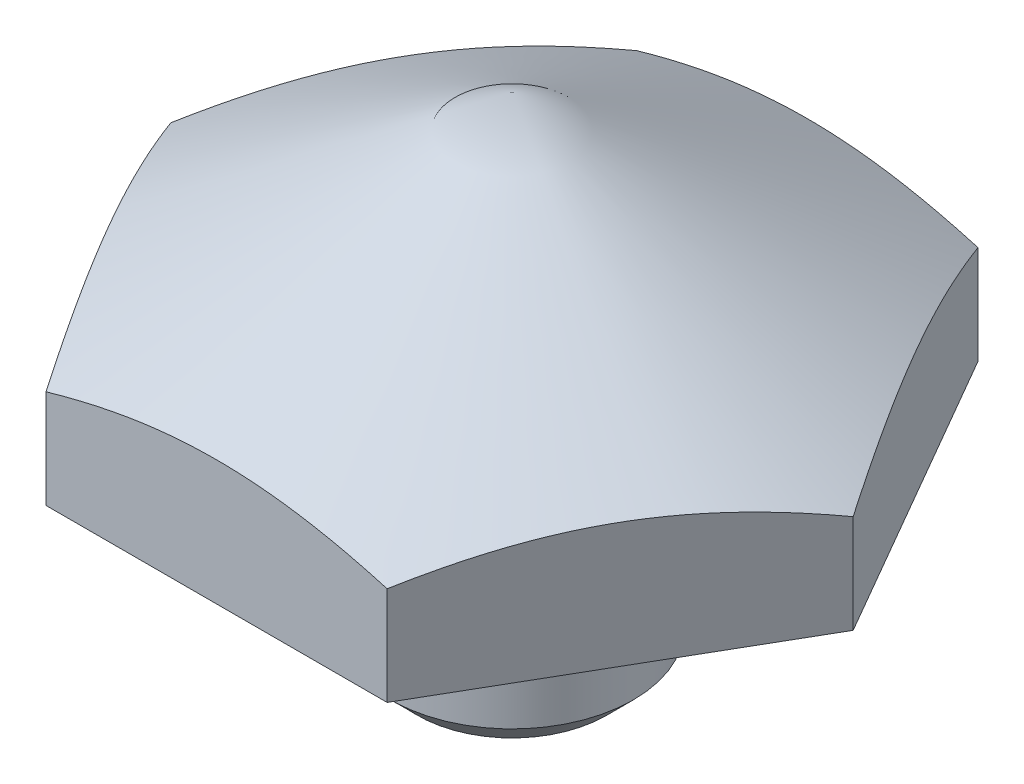
ISO-10303-21;
HEADER;
FILE_DESCRIPTION(('STEP AP214'),'2;1');
FILE_NAME('part.step','',(''),(''),'','','');
FILE_SCHEMA(('AUTOMOTIVE_DESIGN { 1 0 10303 214 1 1 1 1 }'));
ENDSEC;
DATA;
#1=APPLICATION_CONTEXT('core data for automotive mechanical design processes');
#2=APPLICATION_PROTOCOL_DEFINITION('international standard','automotive_design',2000,#1);
#3=PRODUCT_CONTEXT('',#1,'mechanical');
#4=PRODUCT('Part','Part','',(#3));
#5=PRODUCT_RELATED_PRODUCT_CATEGORY('part','',(#4));
#6=PRODUCT_DEFINITION_FORMATION('','',#4);
#7=PRODUCT_DEFINITION_CONTEXT('part definition',#1,'design');
#8=PRODUCT_DEFINITION('design','',#6,#7);
#9=PRODUCT_DEFINITION_SHAPE('','',#8);
#10=(LENGTH_UNIT() NAMED_UNIT(*) SI_UNIT(.MILLI.,.METRE.));
#11=(NAMED_UNIT(*) PLANE_ANGLE_UNIT() SI_UNIT($,.RADIAN.));
#12=(NAMED_UNIT(*) SI_UNIT($,.STERADIAN.) SOLID_ANGLE_UNIT());
#13=UNCERTAINTY_MEASURE_WITH_UNIT(LENGTH_MEASURE(1.E-05),#10,'distance_accuracy_value','');
#14=(GEOMETRIC_REPRESENTATION_CONTEXT(3) GLOBAL_UNCERTAINTY_ASSIGNED_CONTEXT((#13)) GLOBAL_UNIT_ASSIGNED_CONTEXT((#10,
#11,#12)) REPRESENTATION_CONTEXT('',''));
#15=CARTESIAN_POINT('',(0.,0.,0.));
#16=DIRECTION('',(0.,0.,1.));
#17=DIRECTION('',(1.,0.,0.));
#18=AXIS2_PLACEMENT_3D('',#15,#16,#17);
#19=CARTESIAN_POINT('',(0.,0.,0.));
#20=DIRECTION('',(0.,-1.,0.));
#21=DIRECTION('',(1.,0.,0.));
#22=AXIS2_PLACEMENT_3D('',#19,#20,#21);
#23=PLANE('',#22);
#24=CARTESIAN_POINT('',(0.,0.,0.));
#25=DIRECTION('',(0.,-1.,0.));
#26=DIRECTION('',(1.,0.,0.));
#27=AXIS2_PLACEMENT_3D('',#24,#25,#26);
#28=CIRCLE('',#27,3.04800000000001);
#29=CARTESIAN_POINT('',(3.04800000000001,0.,0.));
#30=VERTEX_POINT('',#29);
#31=EDGE_CURVE('E58',#30,#30,#28,.T.);
#32=ORIENTED_EDGE('',*,*,#31,.T.);
#33=EDGE_LOOP('',(#32));
#34=FACE_BOUND('',#33,.T.);
#35=ADVANCED_FACE('F48',(#34),#23,.T.);
#36=CARTESIAN_POINT('',(0.,0.,0.));
#37=DIRECTION('',(0.,1.,0.));
#38=DIRECTION('',(-1.,0.,0.));
#39=AXIS2_PLACEMENT_3D('',#36,#37,#38);
#40=CONICAL_SURFACE('',#39,3.04800000000001,0.785398163397594);
#41=CARTESIAN_POINT('',(0.,0.863599999999742,0.));
#42=DIRECTION('',(0.,-1.,0.));
#43=DIRECTION('',(1.,0.,0.));
#44=AXIS2_PLACEMENT_3D('',#41,#42,#43);
#45=CIRCLE('',#44,3.9116);
#46=CARTESIAN_POINT('',(3.9116,0.863599999999756,0.));
#47=VERTEX_POINT('',#46);
#48=EDGE_CURVE('E204',#47,#47,#45,.T.);
#49=ORIENTED_EDGE('',*,*,#48,.T.);
#50=EDGE_LOOP('',(#49));
#51=FACE_BOUND('',#50,.T.);
#52=ORIENTED_EDGE('',*,*,#31,.F.);
#53=EDGE_LOOP('',(#52));
#54=FACE_BOUND('',#53,.T.);
#55=ADVANCED_FACE('F290',(#51,#54),#40,.T.);
#56=CARTESIAN_POINT('',(3.49148133884313E-12,-1000.,0.));
#57=DIRECTION('',(0.,-1.,0.));
#58=DIRECTION('',(1.,0.,0.));
#59=AXIS2_PLACEMENT_3D('',#56,#57,#58);
#60=CYLINDRICAL_SURFACE('',#59,3.91160000000001);
#61=CARTESIAN_POINT('',(0.,3.50520000000021,0.));
#62=DIRECTION('',(0.,-1.,0.));
#63=DIRECTION('',(1.,0.,0.));
#64=AXIS2_PLACEMENT_3D('',#61,#62,#63);
#65=CIRCLE('',#64,3.91160000000001);
#66=CARTESIAN_POINT('',(3.9116,3.50520000000022,0.));
#67=VERTEX_POINT('',#66);
#68=EDGE_CURVE('E201',#67,#67,#65,.T.);
#69=ORIENTED_EDGE('',*,*,#68,.T.);
#70=EDGE_LOOP('',(#69));
#71=FACE_BOUND('',#70,.T.);
#72=ORIENTED_EDGE('',*,*,#48,.F.);
#73=EDGE_LOOP('',(#72));
#74=FACE_BOUND('',#73,.T.);
#75=ADVANCED_FACE('F295',(#71,#74),#60,.T.);
#76=CARTESIAN_POINT('',(0.,3.50520000000021,0.));
#77=DIRECTION('',(0.,-1.,0.));
#78=DIRECTION('',(1.,0.,0.));
#79=AXIS2_PLACEMENT_3D('',#76,#77,#78);
#80=CONICAL_SURFACE('',#79,3.91160000000001,0.785398163397595);
#81=CARTESIAN_POINT('',(0.,4.36879999999995,0.));
#82=DIRECTION('',(0.,-1.,0.));
#83=DIRECTION('',(1.,0.,0.));
#84=AXIS2_PLACEMENT_3D('',#81,#82,#83);
#85=CIRCLE('',#84,3.04800000000002);
#86=CARTESIAN_POINT('',(3.048,4.36879999999996,0.));
#87=VERTEX_POINT('',#86);
#88=EDGE_CURVE('E198',#87,#87,#85,.T.);
#89=ORIENTED_EDGE('',*,*,#88,.T.);
#90=EDGE_LOOP('',(#89));
#91=FACE_BOUND('',#90,.T.);
#92=ORIENTED_EDGE('',*,*,#68,.F.);
#93=EDGE_LOOP('',(#92));
#94=FACE_BOUND('',#93,.T.);
#95=ADVANCED_FACE('F302',(#91,#94),#80,.T.);
#96=CARTESIAN_POINT('',(3.49148133884313E-12,-1000.,0.));
#97=DIRECTION('',(0.,-1.,0.));
#98=DIRECTION('',(1.,0.,0.));
#99=AXIS2_PLACEMENT_3D('',#96,#97,#98);
#100=CYLINDRICAL_SURFACE('',#99,3.04800000000002);
#101=CARTESIAN_POINT('',(0.,5.96899999999989,0.));
#102=DIRECTION('',(0.,-1.,0.));
#103=DIRECTION('',(1.,0.,0.));
#104=AXIS2_PLACEMENT_3D('',#101,#102,#103);
#105=CIRCLE('',#104,3.04800000000002);
#106=CARTESIAN_POINT('',(3.048,5.9689999999999,0.));
#107=VERTEX_POINT('',#106);
#108=EDGE_CURVE('E194',#107,#107,#105,.T.);
#109=ORIENTED_EDGE('',*,*,#108,.T.);
#110=EDGE_LOOP('',(#109));
#111=FACE_BOUND('',#110,.T.);
#112=ORIENTED_EDGE('',*,*,#88,.F.);
#113=EDGE_LOOP('',(#112));
#114=FACE_BOUND('',#113,.T.);
#115=ADVANCED_FACE('F308',(#111,#114),#100,.T.);
#116=CARTESIAN_POINT('',(0.,5.969,0.));
#117=DIRECTION('',(0.,-1.,0.));
#118=DIRECTION('',(1.,0.,0.));
#119=AXIS2_PLACEMENT_3D('',#116,#117,#118);
#120=TOROIDAL_SURFACE('',#119,3.42900000000002,0.381);
#121=CARTESIAN_POINT('',(0.,6.35000000000008,0.));
#122=DIRECTION('',(0.,-1.,0.));
#123=DIRECTION('',(1.,0.,0.));
#124=AXIS2_PLACEMENT_3D('',#121,#122,#123);
#125=CIRCLE('',#124,3.42900000000003);
#126=CARTESIAN_POINT('',(3.429,6.35000000000009,0.));
#127=VERTEX_POINT('',#126);
#128=EDGE_CURVE('E186',#127,#127,#125,.T.);
#129=ORIENTED_EDGE('',*,*,#128,.T.);
#130=EDGE_LOOP('',(#129));
#131=FACE_BOUND('',#130,.T.);
#132=ORIENTED_EDGE('',*,*,#108,.F.);
#133=EDGE_LOOP('',(#132));
#134=FACE_BOUND('',#133,.T.);
#135=ADVANCED_FACE('F312',(#131,#134),#120,.F.);
#136=CARTESIAN_POINT('',(10.9985175,6.35000000000001,0.));
#137=DIRECTION('',(0.,-1.,0.));
#138=DIRECTION('',(1.,0.,0.));
#139=AXIS2_PLACEMENT_3D('',#136,#137,#138);
#140=PLANE('',#139);
#141=DIRECTION('',(-0.5,0.,0.866025403784439));
#142=VECTOR('',#141,1.);
#143=CARTESIAN_POINT('',(-5.49926259604677,6.34999999999996,-9.52499777948386));
#144=LINE('',#143,#142);
#145=CARTESIAN_POINT('',(-5.49926131403118,6.34999999999999,-9.525));
#146=VERTEX_POINT('',#145);
#147=CARTESIAN_POINT('',(-10.9985226280624,6.34999999999994,0.));
#148=VERTEX_POINT('',#147);
#149=EDGE_CURVE('E110',#146,#148,#144,.T.);
#150=ORIENTED_EDGE('',*,*,#149,.F.);
#151=DIRECTION('',(1.,0.,0.));
#152=VECTOR('',#151,1.);
#153=CARTESIAN_POINT('',(0.,6.34999999999999,-9.525));
#154=LINE('',#153,#152);
#155=CARTESIAN_POINT('',(5.49926131403119,6.35000000000001,-9.525));
#156=VERTEX_POINT('',#155);
#157=EDGE_CURVE('E332',#156,#146,#154,.F.);
#158=ORIENTED_EDGE('',*,*,#157,.F.);
#159=DIRECTION('',(0.5,0.,0.866025403784439));
#160=VECTOR('',#159,1.);
#161=CARTESIAN_POINT('',(8.24889197104678,6.35000000000001,-4.76250000000001));
#162=LINE('',#161,#160);
#163=CARTESIAN_POINT('',(10.9985226280624,6.34999999999999,0.));
#164=VERTEX_POINT('',#163);
#165=EDGE_CURVE('E246',#164,#156,#162,.F.);
#166=ORIENTED_EDGE('',*,*,#165,.F.);
#167=DIRECTION('',(-0.5,0.,0.866025403784439));
#168=VECTOR('',#167,1.);
#169=CARTESIAN_POINT('',(8.24889197104678,6.34999999999999,4.7625));
#170=LINE('',#169,#168);
#171=CARTESIAN_POINT('',(5.49926131403119,6.34999999999996,9.525));
#172=VERTEX_POINT('',#171);
#173=EDGE_CURVE('E130',#172,#164,#170,.F.);
#174=ORIENTED_EDGE('',*,*,#173,.F.);
#175=DIRECTION('',(-1.,0.,0.));
#176=VECTOR('',#175,1.);
#177=CARTESIAN_POINT('',(0.,6.34999999999996,9.525));
#178=LINE('',#177,#176);
#179=CARTESIAN_POINT('',(-5.49925618596527,6.35000000000004,9.52499999999999));
#180=VERTEX_POINT('',#179);
#181=EDGE_CURVE('E195',#180,#172,#178,.F.);
#182=ORIENTED_EDGE('',*,*,#181,.F.);
#183=DIRECTION('',(-0.5,0.,-0.866025403784439));
#184=VECTOR('',#183,1.);
#185=CARTESIAN_POINT('',(-8.24889197104677,6.34999999999994,4.7625));
#186=LINE('',#185,#184);
#187=EDGE_CURVE('E115',#148,#180,#186,.F.);
#188=ORIENTED_EDGE('',*,*,#187,.F.);
#189=EDGE_LOOP('',(#150,#158,#166,#174,#182,#188));
#190=FACE_BOUND('',#189,.T.);
#191=ORIENTED_EDGE('',*,*,#128,.F.);
#192=EDGE_LOOP('',(#191));
#193=FACE_BOUND('',#192,.T.);
#194=ADVANCED_FACE('F288',(#190,#193),#140,.T.);
#195=CARTESIAN_POINT('',(0.,9.52500296068814,0.));
#196=DIRECTION('',(0.,-1.,0.));
#197=DIRECTION('',(1.,0.,0.));
#198=AXIS2_PLACEMENT_3D('',#195,#196,#197);
#199=CONICAL_SURFACE('',#198,10.9985175,1.04719755119659);
#200=CARTESIAN_POINT('',(-10.9986380981162,9.52493333228343,0.00020000000000036));
#201=CARTESIAN_POINT('',(-10.8777523132173,9.59471548472112,-0.209180321357815));
#202=CARTESIAN_POINT('',(-10.7564158029679,9.6613304520109,-0.419341321922845));
#203=CARTESIAN_POINT('',(-10.5127697532954,9.78734721617876,-0.841348659019075));
#204=CARTESIAN_POINT('',(-10.3904599078573,9.84674664065901,-1.05319552558363));
#205=CARTESIAN_POINT('',(-10.0215595864394,10.0129720812612,-1.69214962520807));
#206=CARTESIAN_POINT('',(-9.77351282584137,10.10752035605,-2.12177921721668));
#207=CARTESIAN_POINT('',(-9.40232220358294,10.2183870571234,-2.76470023426138));
#208=CARTESIAN_POINT('',(-9.28028730086356,10.2499688198198,-2.97607088606807));
#209=CARTESIAN_POINT('',(-9.03565248016183,10.3029294328396,-3.39979082482397));
#210=CARTESIAN_POINT('',(-8.9130525513505,10.3243080867878,-3.61214013052952));
#211=CARTESIAN_POINT('',(-8.66764818787801,10.3563147092963,-4.03719295646296));
#212=CARTESIAN_POINT('',(-8.54484417077186,10.3669554533833,-4.24989575346439));
#213=CARTESIAN_POINT('',(-8.29912270270345,10.3772601510179,-4.67549782066928));
#214=CARTESIAN_POINT('',(-8.17620525536318,10.3769244437042,-4.88839708459929));
#215=CARTESIAN_POINT('',(-7.9464080768915,10.366039845737,-5.28641747314822));
#216=CARTESIAN_POINT('',(-7.83951212670956,10.3568187414612,-5.4715666899867));
#217=CARTESIAN_POINT('',(-7.62597023317657,10.3302538849572,-5.84143209913029));
#218=CARTESIAN_POINT('',(-7.5193243080471,10.3129095581435,-6.02614825987472));
#219=CARTESIAN_POINT('',(-7.19979976097279,10.2491018079431,-6.57958100967286));
#220=CARTESIAN_POINT('',(-6.98748672019118,10.1908715644972,-6.94731798341605));
#221=CARTESIAN_POINT('',(-6.56060850831896,10.045295393998,-7.68669273502289));
#222=CARTESIAN_POINT('',(-6.3460978161353,9.95733238962234,-8.05823615265175));
#223=CARTESIAN_POINT('',(-5.92027529884848,9.7576928886128,-8.79578238759941));
#224=CARTESIAN_POINT('',(-5.70895802095901,9.64606328050863,-9.16179464942111));
#225=CARTESIAN_POINT('',(-5.49914584397734,9.52493333228344,-9.5252));
#226=B_SPLINE_CURVE_WITH_KNOTS('',3,(#200,#201,#202,#203,#204,#205,#206,#207,#208,#209,#210,
#211,#212,#213,#214,#215,#216,#217,#218,#219,#220,#221,#222,#223,#224,#225),.UNSPECIFIED.,.F.,
.F.,(4,2,2,2,2,2,2,2,2,2,2,2,4),(0.,0.754861746958004,1.50997101692212,3.02340406075151,
3.76154608748043,4.49970232035707,5.23697928598073,5.97423347202913,6.61604550518408,
7.25790294292824,8.54252993638602,9.85564695316764,11.1661863217647),.UNSPECIFIED.);
#227=CARTESIAN_POINT('',(-10.9985226280624,9.52499999999995,0.));
#228=VERTEX_POINT('',#227);
#229=CARTESIAN_POINT('',(-5.49926131403118,9.52500000000001,-9.525));
#230=VERTEX_POINT('',#229);
#231=EDGE_CURVE('E107',#228,#230,#226,.T.);
#232=ORIENTED_EDGE('',*,*,#231,.F.);
#233=CARTESIAN_POINT('',(-5.49914584397734,9.52493333228344,9.5252));
#234=CARTESIAN_POINT('',(-5.62003162887629,9.59471548472113,9.31581967864218));
#235=CARTESIAN_POINT('',(-5.74136813912567,9.66133045201091,9.10565867807715));
#236=CARTESIAN_POINT('',(-5.98501418879817,9.78734721617877,8.68365134098092));
#237=CARTESIAN_POINT('',(-6.1073240342362,9.84674664065902,8.47180447441636));
#238=CARTESIAN_POINT('',(-6.47622435565419,10.0129720812612,7.83285037479192));
#239=CARTESIAN_POINT('',(-6.72427111625218,10.10752035605,7.40322078278331));
#240=CARTESIAN_POINT('',(-7.09546173851061,10.2183870571234,6.76029976573861));
#241=CARTESIAN_POINT('',(-7.21749664122999,10.2499688198198,6.54892911393192));
#242=CARTESIAN_POINT('',(-7.46213146193172,10.3029294328396,6.12520917517603));
#243=CARTESIAN_POINT('',(-7.58473139074305,10.3243080867878,5.91285986947048));
#244=CARTESIAN_POINT('',(-7.83013575421554,10.3563147092963,5.48780704353703));
#245=CARTESIAN_POINT('',(-7.9529397713217,10.3669554533833,5.2751042465356));
#246=CARTESIAN_POINT('',(-8.1986612393901,10.3772601510179,4.84950217933071));
#247=CARTESIAN_POINT('',(-8.32157868673037,10.3769244437042,4.6366029154007));
#248=CARTESIAN_POINT('',(-8.55137586520205,10.366039845737,4.23858252685177));
#249=CARTESIAN_POINT('',(-8.658271815384,10.3568187414612,4.05343331001329));
#250=CARTESIAN_POINT('',(-8.87181370891698,10.3302538849572,3.6835679008697));
#251=CARTESIAN_POINT('',(-8.97845963404645,10.3129095581435,3.49885174012527));
#252=CARTESIAN_POINT('',(-9.29798418112076,10.249101807943,2.94541899032713));
#253=CARTESIAN_POINT('',(-9.51029722190237,10.1908715644972,2.57768201658395));
#254=CARTESIAN_POINT('',(-9.93717543377459,10.045295393998,1.83830726497711));
#255=CARTESIAN_POINT('',(-10.1516861259582,9.95733238962233,1.46676384734824));
#256=CARTESIAN_POINT('',(-10.5775086432451,9.75769288861279,0.729217612400582));
#257=CARTESIAN_POINT('',(-10.7888259211345,9.64606328050862,0.363205350578884));
#258=CARTESIAN_POINT('',(-10.9986380981162,9.52493333228344,-0.000199999999999045));
#259=B_SPLINE_CURVE_WITH_KNOTS('',3,(#233,#234,#235,#236,#237,#238,#239,#240,#241,#242,#243,
#244,#245,#246,#247,#248,#249,#250,#251,#252,#253,#254,#255,#256,#257,#258),.UNSPECIFIED.,.F.,
.F.,(4,2,2,2,2,2,2,2,2,2,2,2,4),(0.,0.754861746958006,1.50997101692212,3.02340406075152,
3.76154608748043,4.49970232035708,5.23697928598073,5.97423347202914,6.61604550518409,
7.25790294292825,8.54252993638603,9.85564695316764,11.1661863217647),.UNSPECIFIED.);
#260=CARTESIAN_POINT('',(-5.49926131403118,9.52499999999996,9.525));
#261=VERTEX_POINT('',#260);
#262=EDGE_CURVE('E116',#261,#228,#259,.T.);
#263=ORIENTED_EDGE('',*,*,#262,.F.);
#264=CARTESIAN_POINT('',(-14.2412559737771,5.98326950241344,9.525));
#265=CARTESIAN_POINT('',(-14.0356024069978,6.08196142662208,9.525));
#266=CARTESIAN_POINT('',(-13.8296930126171,6.18011999729549,9.525));
#267=CARTESIAN_POINT('',(-13.4173090556836,6.37524862038455,9.525));
#268=CARTESIAN_POINT('',(-13.2108344865837,6.47221865895991,9.525));
#269=CARTESIAN_POINT('',(-12.5904201361046,6.76119233646777,9.525));
#270=CARTESIAN_POINT('',(-12.1755590925935,6.95122614197404,9.525));
#271=CARTESIAN_POINT('',(-11.3403837794639,7.32591808717726,9.525));
#272=CARTESIAN_POINT('',(-10.9200516959353,7.51053662525372,9.525));
#273=CARTESIAN_POINT('',(-10.0758610764656,7.87149818722748,9.525));
#274=CARTESIAN_POINT('',(-9.65200272512179,8.04784164114933,9.525));
#275=CARTESIAN_POINT('',(-8.78891897244706,8.39453470347448,9.525));
#276=CARTESIAN_POINT('',(-8.34958153736609,8.56460705070231,9.525));
#277=CARTESIAN_POINT('',(-7.4655938263015,8.89061217949046,9.525));
#278=CARTESIAN_POINT('',(-7.02094294131626,9.04654332231727,9.525));
#279=CARTESIAN_POINT('',(-6.1266225456532,9.33981224818953,9.525));
#280=CARTESIAN_POINT('',(-5.67696703841585,9.47719224509612,9.525));
#281=CARTESIAN_POINT('',(-4.77126788322584,9.72864426572602,9.525));
#282=CARTESIAN_POINT('',(-4.31522643757226,9.84272412318252,9.525));
#283=CARTESIAN_POINT('',(-3.39756851906725,10.0415029239285,9.525));
#284=CARTESIAN_POINT('',(-2.93596521684215,10.126260939177,9.525));
#285=CARTESIAN_POINT('',(-2.23979419372056,10.2272362883926,9.525));
#286=CARTESIAN_POINT('',(-2.00708868466734,10.2565358984171,9.525));
#287=CARTESIAN_POINT('',(-1.54070167192869,10.3058322937329,9.525));
#288=CARTESIAN_POINT('',(-1.30702026245319,10.3258299569705,9.525));
#289=CARTESIAN_POINT('',(-0.841811713695324,10.3558974987747,9.525));
#290=CARTESIAN_POINT('',(-0.610292050688772,10.3660827428595,9.525));
#291=CARTESIAN_POINT('',(-0.147030730766535,10.3767069264049,9.525));
#292=CARTESIAN_POINT('',(0.0847109227762981,10.3771460116684,9.525));
#293=CARTESIAN_POINT('',(0.548014793618401,10.3682664323471,9.525));
#294=CARTESIAN_POINT('',(0.779577004691084,10.35894744311,9.525));
#295=CARTESIAN_POINT('',(1.24212367980917,10.3307666405425,9.525));
#296=CARTESIAN_POINT('',(1.47310811085914,10.31190429418,9.525));
#297=CARTESIAN_POINT('',(2.04424377639653,10.2538419737831,9.525));
#298=CARTESIAN_POINT('',(2.3838533201872,10.2092314539766,9.525));
#299=CARTESIAN_POINT('',(3.06020905598415,10.1019411715399,9.525));
#300=CARTESIAN_POINT('',(3.39695477921232,10.0392585071409,9.525));
#301=CARTESIAN_POINT('',(4.06737494478736,9.89805455477067,9.525));
#302=CARTESIAN_POINT('',(4.40104654625471,9.81951990543973,9.525));
#303=CARTESIAN_POINT('',(5.06488602718653,9.64897123657108,9.525));
#304=CARTESIAN_POINT('',(5.39505399221553,9.55695754702975,9.525));
#305=CARTESIAN_POINT('',(6.05936393546404,9.35941281184182,9.525));
#306=CARTESIAN_POINT('',(6.3934290273773,9.25362493871038,9.525));
#307=CARTESIAN_POINT('',(7.05826765173582,9.03221716529212,9.525));
#308=CARTESIAN_POINT('',(7.38904116053369,8.91659719442646,9.525));
#309=CARTESIAN_POINT('',(8.04748349524857,8.67726404949839,9.525));
#310=CARTESIAN_POINT('',(8.37515351557186,8.5535541469484,9.525));
#311=CARTESIAN_POINT('',(9.02784943384597,8.29938784763763,9.525));
#312=CARTESIAN_POINT('',(9.35287537530633,8.16893156215265,9.525));
#313=CARTESIAN_POINT('',(10.182544163498,7.82756496651842,9.525));
#314=CARTESIAN_POINT('',(10.685527179245,7.61262445774768,9.525));
#315=CARTESIAN_POINT('',(11.6869620241079,7.17240405022637,9.525));
#316=CARTESIAN_POINT('',(12.1854135083656,6.94712337233097,9.525));
#317=CARTESIAN_POINT('',(13.1787648562252,6.48854668155084,9.525));
#318=CARTESIAN_POINT('',(13.6736637493401,6.25524857221277,9.525));
#319=CARTESIAN_POINT('',(14.6604622223233,5.78244398147187,9.525));
#320=CARTESIAN_POINT('',(15.1523618836154,5.54293766954613,9.525));
#321=CARTESIAN_POINT('',(16.1343182501859,5.05870657251744,9.525));
#322=CARTESIAN_POINT('',(16.6243720221183,4.81397584947814,9.525));
#323=CARTESIAN_POINT('',(17.602477514898,4.32054472285406,9.525));
#324=CARTESIAN_POINT('',(18.0905292245637,4.0718442971365,9.525));
#325=CARTESIAN_POINT('',(19.064897902411,3.5712530608184,9.525));
#326=CARTESIAN_POINT('',(19.5512151238892,3.319362742739,9.525));
#327=CARTESIAN_POINT('',(20.5224626937566,2.81292103174641,9.525));
#328=CARTESIAN_POINT('',(21.0073930375836,2.55836963009212,9.525));
#329=CARTESIAN_POINT('',(22.36900939512,1.83967121570731,9.525));
#330=CARTESIAN_POINT('',(23.2443696116734,1.37301270583702,9.525));
#331=CARTESIAN_POINT('',(24.9922833786375,0.434391149035625,9.525));
#332=CARTESIAN_POINT('',(25.8648368079867,-0.037572122855613,9.525));
#333=CARTESIAN_POINT('',(27.6055517058052,-0.98429053988776,9.525));
#334=CARTESIAN_POINT('',(28.4737187003353,-1.45903553043036,9.525));
#335=CARTESIAN_POINT('',(29.7746765453123,-2.17344559779166,9.525));
#336=CARTESIAN_POINT('',(30.208101414394,-2.41195756986967,9.525));
#337=CARTESIAN_POINT('',(31.0745726433342,-2.88966695441522,9.525));
#338=CARTESIAN_POINT('',(31.507619003618,-3.12886436611141,9.525));
#339=CARTESIAN_POINT('',(31.9404986498679,-3.36836317627665,9.525));
#340=B_SPLINE_CURVE_WITH_KNOTS('',3,(#264,#265,#266,#267,#268,#269,#270,#271,#272,#273,#274,
#275,#276,#277,#278,#279,#280,#281,#282,#283,#284,#285,#286,#287,#288,#289,#290,#291,#292,#293,
#294,#295,#296,#297,#298,#299,#300,#301,#302,#303,#304,#305,#306,#307,#308,#309,#310,#311,#312,
#313,#314,#315,#316,#317,#318,#319,#320,#321,#322,#323,#324,#325,#326,#327,#328,#329,#330,#331,
#332,#333,#334,#335,#336,#337,#338,#339),.UNSPECIFIED.,.F.,.F.,(4,2,2,2,2,2,2,2,2,2,2,2,2,2,2,2,
2,2,2,2,2,2,2,2,2,2,2,2,2,2,2,2,2,2,2,2,2,4),(0.,0.684324066247249,1.36865609379161,
2.73755113324949,4.11474993994302,5.4918770994356,6.90501020542356,8.31830686165055,
9.72833126927447,11.1378808297892,12.5445739367375,13.2480453870125,13.9514504280023,
14.6464807256424,15.3415006256014,16.036543649689,16.7316254988119,17.7586273039386,
18.7857941023842,19.813830324462,20.8418413821693,21.8929025966784,22.9439713567757,
23.9946176693933,25.0452466580266,26.6860293685761,28.3269359178015,29.9682748571889,
31.609569036921,33.2528400727522,34.8961202737227,36.5391497720249,38.1821846690244,
41.1580985359043,44.1341390827229,47.102609982628,48.5867610401277,50.0709104281416),.UNSPECIFIED.);
#341=CARTESIAN_POINT('',(5.49925875000001,9.52500296068816,9.52499555896773));
#342=VERTEX_POINT('',#341);
#343=EDGE_CURVE('E12',#342,#261,#340,.F.);
#344=ORIENTED_EDGE('',*,*,#343,.F.);
#345=CARTESIAN_POINT('',(10.9986380981162,9.52493333228347,-0.000200000000002602));
#346=CARTESIAN_POINT('',(10.8777523132173,9.59471548472115,0.209180321357815));
#347=CARTESIAN_POINT('',(10.7564158029679,9.66133045201093,0.419341321922846));
#348=CARTESIAN_POINT('',(10.5127697532954,9.78734721617879,0.841348659019081));
#349=CARTESIAN_POINT('',(10.3904599078574,9.84674664065904,1.05319552558364));
#350=CARTESIAN_POINT('',(10.0215595864394,10.0129720812612,1.69214962520809));
#351=CARTESIAN_POINT('',(9.77351282584136,10.10752035605,2.12177921721669));
#352=CARTESIAN_POINT('',(9.40232220358293,10.2183870571234,2.7647002342614));
#353=CARTESIAN_POINT('',(9.28028730086355,10.2499688198199,2.97607088606809));
#354=CARTESIAN_POINT('',(9.03565248016182,10.3029294328396,3.39979082482399));
#355=CARTESIAN_POINT('',(8.91305255135049,10.3243080867878,3.61214013052954));
#356=CARTESIAN_POINT('',(8.667648187878,10.3563147092963,4.03719295646299));
#357=CARTESIAN_POINT('',(8.54484417077185,10.3669554533833,4.24989575346442));
#358=CARTESIAN_POINT('',(8.29912270270344,10.3772601510179,4.67549782066932));
#359=CARTESIAN_POINT('',(8.17620525536317,10.3769244437042,4.88839708459933));
#360=CARTESIAN_POINT('',(7.94640807689149,10.366039845737,5.28641747314825));
#361=CARTESIAN_POINT('',(7.83951212670955,10.3568187414613,5.47156668998673));
#362=CARTESIAN_POINT('',(7.62597023317656,10.3302538849573,5.84143209913032));
#363=CARTESIAN_POINT('',(7.51932430804709,10.3129095581436,6.02614825987475));
#364=CARTESIAN_POINT('',(7.19979976097278,10.2491018079431,6.57958100967289));
#365=CARTESIAN_POINT('',(6.98748672019118,10.1908715644973,6.94731798341607));
#366=CARTESIAN_POINT('',(6.56060850831896,10.045295393998,7.6866927350229));
#367=CARTESIAN_POINT('',(6.3460978161353,9.95733238962235,8.05823615265177));
#368=CARTESIAN_POINT('',(5.92027529884848,9.75769288861281,8.79578238759942));
#369=CARTESIAN_POINT('',(5.70895802095902,9.64606328050865,9.16179464942112));
#370=CARTESIAN_POINT('',(5.49914584397735,9.52493333228346,9.5252));
#371=B_SPLINE_CURVE_WITH_KNOTS('',3,(#345,#346,#347,#348,#349,#350,#351,#352,#353,#354,#355,
#356,#357,#358,#359,#360,#361,#362,#363,#364,#365,#366,#367,#368,#369,#370),.UNSPECIFIED.,.F.,
.F.,(4,2,2,2,2,2,2,2,2,2,2,2,4),(0.,0.75486174695801,1.50997101692213,3.02340406075154,
3.76154608748045,4.4997023203571,5.23697928598076,5.97423347202918,6.61604550518412,
7.25790294292827,8.54252993638605,9.85564695316766,11.1661863217647),.UNSPECIFIED.);
#372=CARTESIAN_POINT('',(10.9985226280624,9.52500000000001,0.));
#373=VERTEX_POINT('',#372);
#374=EDGE_CURVE('E66',#373,#342,#371,.T.);
#375=ORIENTED_EDGE('',*,*,#374,.F.);
#376=CARTESIAN_POINT('',(5.49914584397735,9.52493333228346,-9.5252));
#377=CARTESIAN_POINT('',(5.6200316288763,9.59471548472115,-9.31581967864218));
#378=CARTESIAN_POINT('',(5.74136813912568,9.66133045201093,-9.10565867807715));
#379=CARTESIAN_POINT('',(5.98501418879819,9.78734721617878,-8.68365134098092));
#380=CARTESIAN_POINT('',(6.10732403423622,9.84674664065903,-8.47180447441636));
#381=CARTESIAN_POINT('',(6.4762243556542,10.0129720812612,-7.83285037479191));
#382=CARTESIAN_POINT('',(6.7242711162522,10.10752035605,-7.40322078278331));
#383=CARTESIAN_POINT('',(7.09546173851063,10.2183870571234,-6.7602997657386));
#384=CARTESIAN_POINT('',(7.21749664123001,10.2499688198199,-6.54892911393191));
#385=CARTESIAN_POINT('',(7.46213146193174,10.3029294328396,-6.12520917517601));
#386=CARTESIAN_POINT('',(7.58473139074307,10.3243080867878,-5.91285986947046));
#387=CARTESIAN_POINT('',(7.83013575421556,10.3563147092963,-5.48780704353701));
#388=CARTESIAN_POINT('',(7.95293977132172,10.3669554533833,-5.27510424653559));
#389=CARTESIAN_POINT('',(8.19866123939013,10.3772601510179,-4.84950217933069));
#390=CARTESIAN_POINT('',(8.32157868673039,10.3769244437042,-4.63660291540068));
#391=CARTESIAN_POINT('',(8.55137586520208,10.366039845737,-4.23858252685175));
#392=CARTESIAN_POINT('',(8.65827181538402,10.3568187414613,-4.05343331001327));
#393=CARTESIAN_POINT('',(8.871813708917,10.3302538849573,-3.68356790086969));
#394=CARTESIAN_POINT('',(8.97845963404647,10.3129095581436,-3.49885174012525));
#395=CARTESIAN_POINT('',(9.29798418112078,10.2491018079431,-2.94541899032712));
#396=CARTESIAN_POINT('',(9.51029722190239,10.1908715644973,-2.57768201658394));
#397=CARTESIAN_POINT('',(9.9371754337746,10.045295393998,-1.8383072649771));
#398=CARTESIAN_POINT('',(10.1516861259583,9.95733238962236,-1.46676384734824));
#399=CARTESIAN_POINT('',(10.5775086432451,9.75769288861281,-0.729217612400582));
#400=CARTESIAN_POINT('',(10.7888259211345,9.64606328050865,-0.363205350578885));
#401=CARTESIAN_POINT('',(10.9986380981162,9.52493333228347,0.000199999999997039));
#402=B_SPLINE_CURVE_WITH_KNOTS('',3,(#376,#377,#378,#379,#380,#381,#382,#383,#384,#385,#386,
#387,#388,#389,#390,#391,#392,#393,#394,#395,#396,#397,#398,#399,#400,#401),.UNSPECIFIED.,.F.,
.F.,(4,2,2,2,2,2,2,2,2,2,2,2,4),(0.,0.754861746958009,1.50997101692213,3.02340406075153,
3.76154608748045,4.4997023203571,5.23697928598075,5.97423347202917,6.61604550518411,
7.25790294292826,8.54252993638604,9.85564695316765,11.1661863217647),.UNSPECIFIED.);
#403=CARTESIAN_POINT('',(5.49926131403119,9.52500000000001,-9.525));
#404=VERTEX_POINT('',#403);
#405=EDGE_CURVE('E283',#404,#373,#402,.T.);
#406=ORIENTED_EDGE('',*,*,#405,.F.);
#407=CARTESIAN_POINT('',(-14.4678080211996,5.87428179348609,-9.525));
#408=CARTESIAN_POINT('',(-14.2609514038813,5.97403127141481,-9.525));
#409=CARTESIAN_POINT('',(-14.0538435655999,6.07325952840543,-9.525));
#410=CARTESIAN_POINT('',(-13.6390728872087,6.27055484551369,-9.525));
#411=CARTESIAN_POINT('',(-13.4314100410438,6.36862189289912,-9.525));
#412=CARTESIAN_POINT('',(-12.8074503086714,6.66093104320496,-9.525));
#413=CARTESIAN_POINT('',(-12.3902484880403,6.85324911049763,-9.525));
#414=CARTESIAN_POINT('',(-11.550528474118,7.23263190037604,-9.525));
#415=CARTESIAN_POINT('',(-11.127993469575,7.41965950825192,-9.525));
#416=CARTESIAN_POINT('',(-10.2794531418081,7.78564073207914,-9.525));
#417=CARTESIAN_POINT('',(-9.85344799384715,7.96459475284668,-9.525));
#418=CARTESIAN_POINT('',(-8.9850961871993,8.31723181072282,-9.525));
#419=CARTESIAN_POINT('',(-8.54262925335827,8.49062037309703,-9.525));
#420=CARTESIAN_POINT('',(-7.65241011624814,8.82352380226414,-9.525));
#421=CARTESIAN_POINT('',(-7.20465731152943,8.98303707264381,-9.525));
#422=CARTESIAN_POINT('',(-6.30408851359343,9.2837794140292,-9.525));
#423=CARTESIAN_POINT('',(-5.85128594201515,9.42504822662201,-9.525));
#424=CARTESIAN_POINT('',(-4.93921491102381,9.68457455567023,-9.525));
#425=CARTESIAN_POINT('',(-4.4799486323429,9.80283964260559,-9.525));
#426=CARTESIAN_POINT('',(-3.55692989232988,10.0099090294757,-9.525));
#427=CARTESIAN_POINT('',(-3.09320912182196,10.098850661464,-9.525));
#428=CARTESIAN_POINT('',(-2.39366079310544,10.2062382750008,-9.525));
#429=CARTESIAN_POINT('',(-2.15979788196094,10.2376981548371,-9.525));
#430=CARTESIAN_POINT('',(-1.69101600988773,10.2913204914671,-9.525));
#431=CARTESIAN_POINT('',(-1.45609715182376,10.3134838348573,-9.525));
#432=CARTESIAN_POINT('',(-0.988451302051758,10.3478085624607,-9.525));
#433=CARTESIAN_POINT('',(-0.755733178247751,10.3600903701952,-9.525));
#434=CARTESIAN_POINT('',(-0.289987084494971,10.3748285910995,-9.525));
#435=CARTESIAN_POINT('',(-0.0569591194553899,10.3772851581297,-9.525));
#436=CARTESIAN_POINT('',(0.408998493319074,10.3723143685412,-9.525));
#437=CARTESIAN_POINT('',(0.641928138035543,10.3648867278302,-9.525));
#438=CARTESIAN_POINT('',(1.10727831981505,10.3403222943857,-9.525));
#439=CARTESIAN_POINT('',(1.3396988295269,10.3231849922875,-9.525));
#440=CARTESIAN_POINT('',(1.90756448970306,10.2698025521247,-9.525));
#441=CARTESIAN_POINT('',(2.24253602564646,10.2284373096795,-9.525));
#442=CARTESIAN_POINT('',(2.90979231465026,10.1278657882925,-9.525));
#443=CARTESIAN_POINT('',(3.2420766567943,10.06865683181,-9.525));
#444=CARTESIAN_POINT('',(3.90370289050755,9.93450437060033,-9.525));
#445=CARTESIAN_POINT('',(4.23304218725596,9.8595481892865,-9.525));
#446=CARTESIAN_POINT('',(4.88832402943784,9.6961659677389,-9.525));
#447=CARTESIAN_POINT('',(5.21426664360978,9.60774020065618,-9.525));
#448=CARTESIAN_POINT('',(5.87022559120453,9.41737045836714,-9.525));
#449=CARTESIAN_POINT('',(6.20016527399078,9.31516415315289,-9.525));
#450=CARTESIAN_POINT('',(6.856790925853,9.10083663177368,-9.525));
#451=CARTESIAN_POINT('',(7.18347687126388,8.9887153435536,-9.525));
#452=CARTESIAN_POINT('',(7.83377321731635,8.75628197619118,-9.525));
#453=CARTESIAN_POINT('',(8.15738470309098,8.6359729193642,-9.525));
#454=CARTESIAN_POINT('',(8.80196417164135,8.38851617557001,-9.525));
#455=CARTESIAN_POINT('',(9.12293220405826,8.26136861736162,-9.525));
#456=CARTESIAN_POINT('',(9.96334601869173,7.919774569525,-9.525));
#457=CARTESIAN_POINT('',(10.4808838017523,7.70063777078449,-9.525));
#458=CARTESIAN_POINT('',(11.5110479904109,7.25107299111178,-9.525));
#459=CARTESIAN_POINT('',(12.0236739593185,7.02064401716962,-9.525));
#460=CARTESIAN_POINT('',(13.0451117671718,6.55110416167124,-9.525));
#461=CARTESIAN_POINT('',(13.553922396303,6.31199065601537,-9.525));
#462=CARTESIAN_POINT('',(14.568328169473,5.82709846186822,-9.525));
#463=CARTESIAN_POINT('',(15.0739234161434,5.58131998744717,-9.525));
#464=CARTESIAN_POINT('',(16.0831969729307,5.08417819301576,-9.525));
#465=CARTESIAN_POINT('',(16.5868718109031,4.83280783725433,-9.525));
#466=CARTESIAN_POINT('',(17.5921013241559,4.32586119585024,-9.525));
#467=CARTESIAN_POINT('',(18.0936559854644,4.0702848825448,-9.525));
#468=CARTESIAN_POINT('',(19.0949275206469,3.55577650054468,-9.525));
#469=CARTESIAN_POINT('',(19.5946447028099,3.29684503115698,-9.525));
#470=CARTESIAN_POINT('',(20.5926247480063,2.77619301256087,-9.525));
#471=CARTESIAN_POINT('',(21.0908876059846,2.51447245367258,-9.525));
#472=CARTESIAN_POINT('',(22.484983930082,1.77808952491318,-9.525));
#473=CARTESIAN_POINT('',(23.379454932364,1.3008481829097,-9.525));
#474=CARTESIAN_POINT('',(25.1655199063614,0.340918822763306,-9.525));
#475=CARTESIAN_POINT('',(26.0571137342267,-0.141769462446424,-9.525));
#476=CARTESIAN_POINT('',(27.8355801029088,-1.10987164927946,-9.525));
#477=CARTESIAN_POINT('',(28.7224588722582,-1.59527411562561,-9.525));
#478=CARTESIAN_POINT('',(30.051457316436,-2.32570895203507,-9.525));
#479=CARTESIAN_POINT('',(30.4942227240001,-2.56956792683505,-9.525));
#480=CARTESIAN_POINT('',(31.3793685867922,-3.05798238390162,-9.525));
#481=CARTESIAN_POINT('',(31.821749042457,-3.30253786537686,-9.525));
#482=CARTESIAN_POINT('',(32.263960256359,-3.54739906588904,-9.525));
#483=B_SPLINE_CURVE_WITH_KNOTS('',3,(#407,#408,#409,#410,#411,#412,#413,#414,#415,#416,#417,
#418,#419,#420,#421,#422,#423,#424,#425,#426,#427,#428,#429,#430,#431,#432,#433,#434,#435,#436,
#437,#438,#439,#440,#441,#442,#443,#444,#445,#446,#447,#448,#449,#450,#451,#452,#453,#454,#455,
#456,#457,#458,#459,#460,#461,#462,#463,#464,#465,#466,#467,#468,#469,#470,#471,#472,#473,#474,
#475,#476,#477,#478,#479,#480,#481,#482),.UNSPECIFIED.,.F.,.F.,(4,2,2,2,2,2,2,2,2,2,2,2,2,2,2,2,
2,2,2,2,2,2,2,2,2,2,2,2,2,2,2,2,2,2,2,2,2,4),(0.,0.688951891745139,1.37791133059398,
2.75605099796862,4.1422162148099,5.52831185078318,6.95381224872093,8.37947644039693,
9.80198078304663,11.2240161873502,12.6392938286344,13.3470463287911,14.0547313163169,
14.7536554542798,15.4525686472448,16.1515019288284,16.850471879539,17.8624536255904,
18.8745873003598,19.8875388909093,20.9004699424482,21.9365045908903,22.9725467691224,
24.0082085704028,25.0438508785336,26.7297113931686,28.4157204257711,30.1022432082038,
31.7887118857052,33.4774381642806,35.1661755541233,36.8546153452407,38.5430609982141,
41.5845016706041,44.626092120205,47.6591553204851,49.1755900447211,50.692023046733),.UNSPECIFIED.);
#484=EDGE_CURVE('E124',#230,#404,#483,.T.);
#485=ORIENTED_EDGE('',*,*,#484,.F.);
#486=EDGE_LOOP('',(#232,#263,#344,#375,#406,#485));
#487=FACE_BOUND('',#486,.T.);
#488=CARTESIAN_POINT('',(0.,15.875,0.));
#489=VERTEX_POINT('',#488);
#490=VERTEX_LOOP('',#489);
#491=FACE_BOUND('',#490,.T.);
#492=ADVANCED_FACE('F121',(#487,#491),#199,.T.);
#493=CARTESIAN_POINT('',(0.,15.875,9.525));
#494=DIRECTION('',(0.,0.,-1.));
#495=DIRECTION('',(-1.,0.,0.));
#496=AXIS2_PLACEMENT_3D('',#493,#494,#495);
#497=PLANE('',#496);
#498=ORIENTED_EDGE('',*,*,#181,.T.);
#499=CARTESIAN_POINT('',(5.49926131403119,9.52500296068816,9.525));
#500=DIRECTION('',(0.,-1.,0.));
#501=VECTOR('',#500,1.);
#502=LINE('',#499,#501);
#503=EDGE_CURVE('E182',#342,#172,#502,.T.);
#504=ORIENTED_EDGE('',*,*,#503,.F.);
#505=ORIENTED_EDGE('',*,*,#343,.T.);
#506=CARTESIAN_POINT('',(-5.49925105789936,9.52500296068814,9.525));
#507=DIRECTION('',(0.,-1.,0.));
#508=VECTOR('',#507,1.);
#509=LINE('',#506,#508);
#510=EDGE_CURVE('E128',#261,#180,#509,.T.);
#511=ORIENTED_EDGE('',*,*,#510,.T.);
#512=EDGE_LOOP('',(#498,#504,#505,#511));
#513=FACE_BOUND('',#512,.T.);
#514=ADVANCED_FACE('F154',(#513),#497,.F.);
#515=CARTESIAN_POINT('',(-8.24889197104677,15.875,4.7625));
#516=DIRECTION('',(0.866025403784439,0.,-0.5));
#517=DIRECTION('',(-0.5,0.,-0.866025403784439));
#518=AXIS2_PLACEMENT_3D('',#515,#516,#517);
#519=PLANE('',#518);
#520=ORIENTED_EDGE('',*,*,#187,.T.);
#521=ORIENTED_EDGE('',*,*,#510,.F.);
#522=ORIENTED_EDGE('',*,*,#262,.T.);
#523=CARTESIAN_POINT('',(-10.9985174999938,9.52500296068814,8.8820752454366E-06));
#524=DIRECTION('',(0.,-1.,0.));
#525=VECTOR('',#524,1.);
#526=LINE('',#523,#525);
#527=EDGE_CURVE('E104',#228,#148,#526,.T.);
#528=ORIENTED_EDGE('',*,*,#527,.T.);
#529=EDGE_LOOP('',(#520,#521,#522,#528));
#530=FACE_BOUND('',#529,.T.);
#531=ADVANCED_FACE('F126',(#530),#519,.F.);
#532=CARTESIAN_POINT('',(8.24889197104678,15.875,4.7625));
#533=DIRECTION('',(-0.866025403784439,0.,-0.5));
#534=DIRECTION('',(-0.5,0.,0.866025403784439));
#535=AXIS2_PLACEMENT_3D('',#532,#533,#534);
#536=PLANE('',#535);
#537=ORIENTED_EDGE('',*,*,#173,.T.);
#538=CARTESIAN_POINT('',(10.9985226280624,9.52500000000001,0.));
#539=DIRECTION('',(0.,-1.,0.));
#540=VECTOR('',#539,1.);
#541=LINE('',#538,#540);
#542=EDGE_CURVE('E133',#373,#164,#541,.T.);
#543=ORIENTED_EDGE('',*,*,#542,.F.);
#544=ORIENTED_EDGE('',*,*,#374,.T.);
#545=ORIENTED_EDGE('',*,*,#503,.T.);
#546=EDGE_LOOP('',(#537,#543,#544,#545));
#547=FACE_BOUND('',#546,.T.);
#548=ADVANCED_FACE('F153',(#547),#536,.F.);
#549=CARTESIAN_POINT('',(8.24889197104678,15.875,-4.76250000000001));
#550=DIRECTION('',(-0.866025403784439,0.,0.5));
#551=DIRECTION('',(0.5,0.,0.866025403784439));
#552=AXIS2_PLACEMENT_3D('',#549,#550,#551);
#553=PLANE('',#552);
#554=ORIENTED_EDGE('',*,*,#165,.T.);
#555=CARTESIAN_POINT('',(5.49926131403119,9.52500000000001,-9.525));
#556=DIRECTION('',(0.,-1.,0.));
#557=VECTOR('',#556,1.);
#558=LINE('',#555,#557);
#559=EDGE_CURVE('E337',#404,#156,#558,.T.);
#560=ORIENTED_EDGE('',*,*,#559,.F.);
#561=ORIENTED_EDGE('',*,*,#405,.T.);
#562=ORIENTED_EDGE('',*,*,#542,.T.);
#563=EDGE_LOOP('',(#554,#560,#561,#562));
#564=FACE_BOUND('',#563,.T.);
#565=ADVANCED_FACE('F248',(#564),#553,.F.);
#566=CARTESIAN_POINT('',(0.,15.875,-9.525));
#567=DIRECTION('',(0.,0.,1.));
#568=DIRECTION('',(1.,0.,0.));
#569=AXIS2_PLACEMENT_3D('',#566,#567,#568);
#570=PLANE('',#569);
#571=ORIENTED_EDGE('',*,*,#157,.T.);
#572=CARTESIAN_POINT('',(-5.49926131403118,9.52500000000001,-9.525));
#573=DIRECTION('',(0.,-1.,0.));
#574=VECTOR('',#573,1.);
#575=LINE('',#572,#574);
#576=EDGE_CURVE('E335',#230,#146,#575,.T.);
#577=ORIENTED_EDGE('',*,*,#576,.F.);
#578=ORIENTED_EDGE('',*,*,#484,.T.);
#579=ORIENTED_EDGE('',*,*,#559,.T.);
#580=EDGE_LOOP('',(#571,#577,#578,#579));
#581=FACE_BOUND('',#580,.T.);
#582=ADVANCED_FACE('F257',(#581),#570,.F.);
#583=CARTESIAN_POINT('',(-8.24889197104677,15.875,-4.7625));
#584=DIRECTION('',(0.866025403784439,0.,0.5));
#585=DIRECTION('',(0.5,0.,-0.866025403784439));
#586=AXIS2_PLACEMENT_3D('',#583,#584,#585);
#587=PLANE('',#586);
#588=ORIENTED_EDGE('',*,*,#149,.T.);
#589=ORIENTED_EDGE('',*,*,#527,.F.);
#590=ORIENTED_EDGE('',*,*,#231,.T.);
#591=ORIENTED_EDGE('',*,*,#576,.T.);
#592=EDGE_LOOP('',(#588,#589,#590,#591));
#593=FACE_BOUND('',#592,.T.);
#594=ADVANCED_FACE('F106',(#593),#587,.F.);
#595=CLOSED_SHELL('',(#35,#55,#75,#95,#115,#135,#194,#492,#514,#531,#548,#565,#582,#594));
#596=MANIFOLD_SOLID_BREP('B2',#595);
#597=ADVANCED_BREP_SHAPE_REPRESENTATION('',(#18,#596),#14);
#598=SHAPE_DEFINITION_REPRESENTATION(#9,#597);
ENDSEC;
END-ISO-10303-21;
